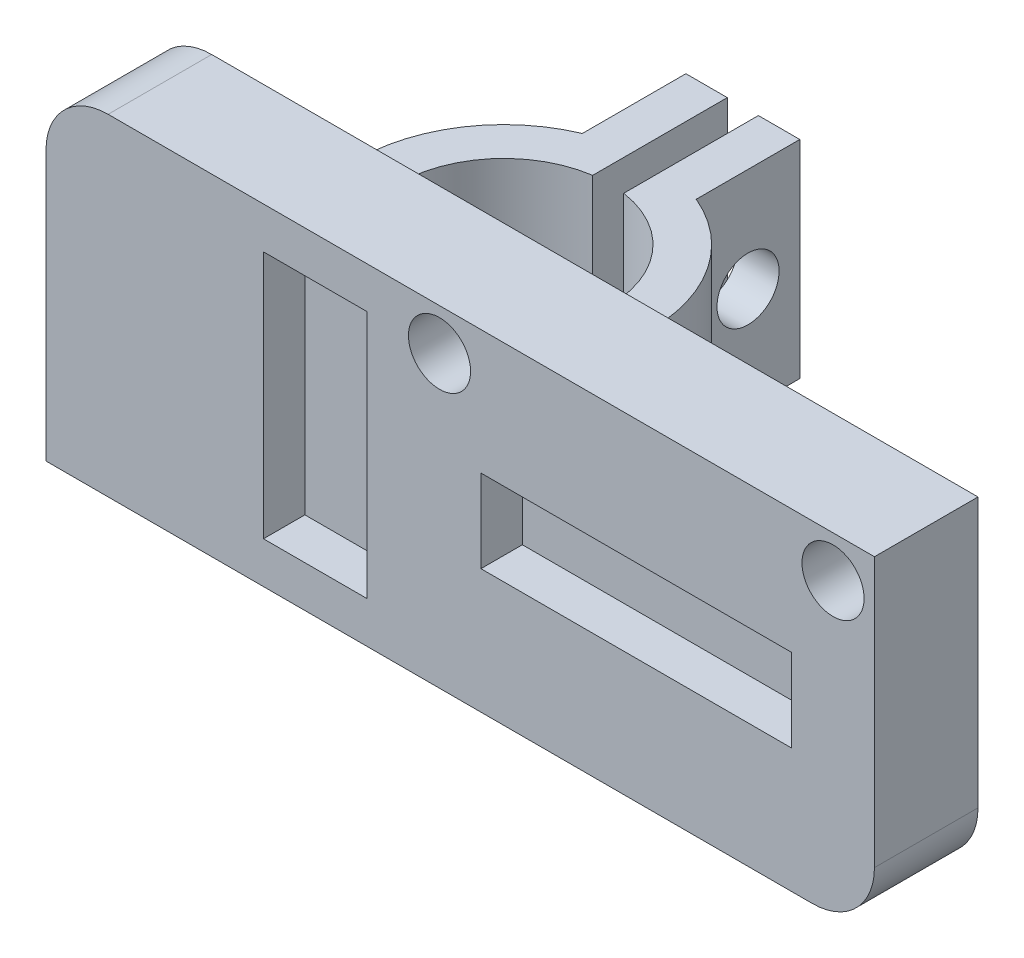
ISO-10303-21;
HEADER;
FILE_DESCRIPTION(('STEP AP214'),'2;1');
FILE_NAME('part.step','',(''),(''),'','','');
FILE_SCHEMA(('AUTOMOTIVE_DESIGN { 1 0 10303 214 1 1 1 1 }'));
ENDSEC;
DATA;
#1=APPLICATION_CONTEXT('core data for automotive mechanical design processes');
#2=APPLICATION_PROTOCOL_DEFINITION('international standard','automotive_design',2000,#1);
#3=PRODUCT_CONTEXT('',#1,'mechanical');
#4=PRODUCT('Part','Part','',(#3));
#5=PRODUCT_RELATED_PRODUCT_CATEGORY('part','',(#4));
#6=PRODUCT_DEFINITION_FORMATION('','',#4);
#7=PRODUCT_DEFINITION_CONTEXT('part definition',#1,'design');
#8=PRODUCT_DEFINITION('design','',#6,#7);
#9=PRODUCT_DEFINITION_SHAPE('','',#8);
#10=(LENGTH_UNIT() NAMED_UNIT(*) SI_UNIT(.MILLI.,.METRE.));
#11=(NAMED_UNIT(*) PLANE_ANGLE_UNIT() SI_UNIT($,.RADIAN.));
#12=(NAMED_UNIT(*) SI_UNIT($,.STERADIAN.) SOLID_ANGLE_UNIT());
#13=UNCERTAINTY_MEASURE_WITH_UNIT(LENGTH_MEASURE(1.E-05),#10,'distance_accuracy_value','');
#14=(GEOMETRIC_REPRESENTATION_CONTEXT(3) GLOBAL_UNCERTAINTY_ASSIGNED_CONTEXT((#13)) GLOBAL_UNIT_ASSIGNED_CONTEXT((#10,
#11,#12)) REPRESENTATION_CONTEXT('',''));
#15=CARTESIAN_POINT('',(0.,0.,0.));
#16=DIRECTION('',(0.,0.,1.));
#17=DIRECTION('',(1.,0.,0.));
#18=AXIS2_PLACEMENT_3D('',#15,#16,#17);
#19=CARTESIAN_POINT('',(0.,0.,-5.));
#20=DIRECTION('',(0.,0.,1.));
#21=DIRECTION('',(1.,0.,0.));
#22=AXIS2_PLACEMENT_3D('',#19,#20,#21);
#23=PLANE('',#22);
#24=CARTESIAN_POINT('',(19.,14.,-5.));
#25=DIRECTION('',(0.,0.,1.));
#26=DIRECTION('',(1.,0.,0.));
#27=AXIS2_PLACEMENT_3D('',#24,#25,#26);
#28=CIRCLE('',#27,1.5);
#29=CARTESIAN_POINT('',(20.5,14.,-5.));
#30=VERTEX_POINT('',#29);
#31=EDGE_CURVE('E413',#30,#30,#28,.T.);
#32=ORIENTED_EDGE('',*,*,#31,.T.);
#33=EDGE_LOOP('',(#32));
#34=FACE_BOUND('',#33,.T.);
#35=CARTESIAN_POINT('',(38.,14.,-5.));
#36=DIRECTION('',(0.,0.,1.));
#37=DIRECTION('',(1.,0.,0.));
#38=AXIS2_PLACEMENT_3D('',#35,#36,#37);
#39=CIRCLE('',#38,1.5);
#40=CARTESIAN_POINT('',(39.5,14.,-5.));
#41=VERTEX_POINT('',#40);
#42=EDGE_CURVE('E410',#41,#41,#39,.T.);
#43=ORIENTED_EDGE('',*,*,#42,.T.);
#44=EDGE_LOOP('',(#43));
#45=FACE_BOUND('',#44,.T.);
#46=DIRECTION('',(0.,-1.,0.));
#47=VECTOR('',#46,1.);
#48=CARTESIAN_POINT('',(4.9,10.,-5.));
#49=LINE('',#48,#47);
#50=CARTESIAN_POINT('',(4.9,10.,-5.));
#51=VERTEX_POINT('',#50);
#52=CARTESIAN_POINT('',(4.9,0.,-5.));
#53=VERTEX_POINT('',#52);
#54=EDGE_CURVE('E98',#51,#53,#49,.T.);
#55=ORIENTED_EDGE('',*,*,#54,.T.);
#56=DIRECTION('',(1.,0.,0.));
#57=VECTOR('',#56,1.);
#58=CARTESIAN_POINT('',(0.,0.,-5.));
#59=LINE('',#58,#57);
#60=CARTESIAN_POINT('',(0.,0.,-5.));
#61=VERTEX_POINT('',#60);
#62=EDGE_CURVE('E261',#61,#53,#59,.T.);
#63=ORIENTED_EDGE('',*,*,#62,.F.);
#64=DIRECTION('',(0.,-1.,0.));
#65=VECTOR('',#64,1.);
#66=CARTESIAN_POINT('',(0.,0.,-5.));
#67=LINE('',#66,#65);
#68=CARTESIAN_POINT('',(0.,13.,-5.));
#69=VERTEX_POINT('',#68);
#70=EDGE_CURVE('E426',#69,#61,#67,.T.);
#71=ORIENTED_EDGE('',*,*,#70,.F.);
#72=CARTESIAN_POINT('',(3.,13.,-5.));
#73=DIRECTION('',(0.,0.,1.));
#74=DIRECTION('',(1.,0.,0.));
#75=AXIS2_PLACEMENT_3D('',#72,#73,#74);
#76=CIRCLE('',#75,3.);
#77=CARTESIAN_POINT('',(3.,16.,-5.));
#78=VERTEX_POINT('',#77);
#79=EDGE_CURVE('E424',#69,#78,#76,.F.);
#80=ORIENTED_EDGE('',*,*,#79,.T.);
#81=DIRECTION('',(1.,0.,0.));
#82=VECTOR('',#81,1.);
#83=CARTESIAN_POINT('',(0.,16.,-5.));
#84=LINE('',#83,#82);
#85=CARTESIAN_POINT('',(40.,16.,-5.));
#86=VERTEX_POINT('',#85);
#87=EDGE_CURVE('E422',#78,#86,#84,.T.);
#88=ORIENTED_EDGE('',*,*,#87,.T.);
#89=DIRECTION('',(0.,-1.,0.));
#90=VECTOR('',#89,1.);
#91=CARTESIAN_POINT('',(40.,0.,-5.));
#92=LINE('',#91,#90);
#93=CARTESIAN_POINT('',(40.,3.,-5.));
#94=VERTEX_POINT('',#93);
#95=EDGE_CURVE('E420',#86,#94,#92,.T.);
#96=ORIENTED_EDGE('',*,*,#95,.T.);
#97=CARTESIAN_POINT('',(37.,3.,-5.));
#98=DIRECTION('',(0.,0.,1.));
#99=DIRECTION('',(1.,0.,0.));
#100=AXIS2_PLACEMENT_3D('',#97,#98,#99);
#101=CIRCLE('',#100,3.);
#102=CARTESIAN_POINT('',(37.,0.,-5.));
#103=VERTEX_POINT('',#102);
#104=EDGE_CURVE('E417',#94,#103,#101,.F.);
#105=ORIENTED_EDGE('',*,*,#104,.T.);
#106=CARTESIAN_POINT('',(19.1,0.,-5.));
#107=VERTEX_POINT('',#106);
#108=EDGE_CURVE('E429',#107,#103,#59,.T.);
#109=ORIENTED_EDGE('',*,*,#108,.F.);
#110=DIRECTION('',(0.,-1.,0.));
#111=VECTOR('',#110,1.);
#112=CARTESIAN_POINT('',(19.1,10.,-5.));
#113=LINE('',#112,#111);
#114=CARTESIAN_POINT('',(19.1,10.,-5.));
#115=VERTEX_POINT('',#114);
#116=EDGE_CURVE('E333',#115,#107,#113,.T.);
#117=ORIENTED_EDGE('',*,*,#116,.F.);
#118=DIRECTION('',(1.,0.,0.));
#119=VECTOR('',#118,1.);
#120=CARTESIAN_POINT('',(0.,10.,-5.));
#121=LINE('',#120,#119);
#122=CARTESIAN_POINT('',(12.,10.,-5.));
#123=VERTEX_POINT('',#122);
#124=EDGE_CURVE('E316',#123,#115,#121,.T.);
#125=ORIENTED_EDGE('',*,*,#124,.F.);
#126=DIRECTION('',(1.,0.,0.));
#127=VECTOR('',#126,1.);
#128=CARTESIAN_POINT('',(0.,10.,-5.));
#129=LINE('',#128,#127);
#130=EDGE_CURVE('E93',#51,#123,#129,.T.);
#131=ORIENTED_EDGE('',*,*,#130,.F.);
#132=EDGE_LOOP('',(#55,#63,#71,#80,#88,#96,#105,#109,#117,#125,#131));
#133=FACE_BOUND('',#132,.T.);
#134=ADVANCED_FACE('F76',(#34,#45,#133),#23,.F.);
#135=CARTESIAN_POINT('',(37.,3.,-5.));
#136=DIRECTION('',(0.,0.,1.));
#137=DIRECTION('',(1.,0.,0.));
#138=AXIS2_PLACEMENT_3D('',#135,#136,#137);
#139=CYLINDRICAL_SURFACE('',#138,3.);
#140=CARTESIAN_POINT('',(37.,3.,0.));
#141=DIRECTION('',(0.,0.,1.));
#142=DIRECTION('',(1.,0.,0.));
#143=AXIS2_PLACEMENT_3D('',#140,#141,#142);
#144=CIRCLE('',#143,3.);
#145=CARTESIAN_POINT('',(40.,3.,0.));
#146=VERTEX_POINT('',#145);
#147=CARTESIAN_POINT('',(37.,0.,0.));
#148=VERTEX_POINT('',#147);
#149=EDGE_CURVE('E437',#146,#148,#144,.F.);
#150=ORIENTED_EDGE('',*,*,#149,.T.);
#151=DIRECTION('',(0.,0.,1.));
#152=VECTOR('',#151,1.);
#153=CARTESIAN_POINT('',(37.,0.,-5.));
#154=LINE('',#153,#152);
#155=EDGE_CURVE('E12',#103,#148,#154,.T.);
#156=ORIENTED_EDGE('',*,*,#155,.F.);
#157=ORIENTED_EDGE('',*,*,#104,.F.);
#158=DIRECTION('',(0.,0.,1.));
#159=VECTOR('',#158,1.);
#160=CARTESIAN_POINT('',(40.,3.,-5.));
#161=LINE('',#160,#159);
#162=EDGE_CURVE('E431',#94,#146,#161,.T.);
#163=ORIENTED_EDGE('',*,*,#162,.T.);
#164=EDGE_LOOP('',(#150,#156,#157,#163));
#165=FACE_BOUND('',#164,.T.);
#166=ADVANCED_FACE('F464',(#165),#139,.T.);
#167=CARTESIAN_POINT('',(0.,0.,-5.));
#168=DIRECTION('',(0.,-1.,0.));
#169=DIRECTION('',(0.,0.,-1.));
#170=AXIS2_PLACEMENT_3D('',#167,#168,#169);
#171=PLANE('',#170);
#172=DIRECTION('',(1.,0.,0.));
#173=VECTOR('',#172,1.);
#174=CARTESIAN_POINT('',(0.,0.,0.));
#175=LINE('',#174,#173);
#176=CARTESIAN_POINT('',(0.,0.,0.));
#177=VERTEX_POINT('',#176);
#178=EDGE_CURVE('E414',#177,#148,#175,.T.);
#179=ORIENTED_EDGE('',*,*,#178,.F.);
#180=DIRECTION('',(0.,0.,1.));
#181=VECTOR('',#180,1.);
#182=CARTESIAN_POINT('',(0.,0.,-5.));
#183=LINE('',#182,#181);
#184=EDGE_CURVE('E85',#61,#177,#183,.T.);
#185=ORIENTED_EDGE('',*,*,#184,.F.);
#186=ORIENTED_EDGE('',*,*,#62,.T.);
#187=DIRECTION('',(0.,0.,1.));
#188=VECTOR('',#187,1.);
#189=CARTESIAN_POINT('',(4.9,0.,0.));
#190=LINE('',#189,#188);
#191=CARTESIAN_POINT('',(4.9,0.,-10.1));
#192=VERTEX_POINT('',#191);
#193=EDGE_CURVE('E254',#192,#53,#190,.T.);
#194=ORIENTED_EDGE('',*,*,#193,.F.);
#195=CARTESIAN_POINT('',(12.,0.,-10.1));
#196=DIRECTION('',(0.,-1.,0.));
#197=DIRECTION('',(0.,0.,-1.));
#198=AXIS2_PLACEMENT_3D('',#195,#196,#197);
#199=CIRCLE('',#198,7.1);
#200=CARTESIAN_POINT('',(9.25,0.,-16.6458001802683));
#201=VERTEX_POINT('',#200);
#202=EDGE_CURVE('E260',#201,#192,#199,.F.);
#203=ORIENTED_EDGE('',*,*,#202,.F.);
#204=DIRECTION('',(0.,0.,1.));
#205=VECTOR('',#204,1.);
#206=CARTESIAN_POINT('',(9.24999999999999,0.,0.));
#207=LINE('',#206,#205);
#208=CARTESIAN_POINT('',(9.25,0.,-21.6458001802683));
#209=VERTEX_POINT('',#208);
#210=EDGE_CURVE('E284',#209,#201,#207,.T.);
#211=ORIENTED_EDGE('',*,*,#210,.F.);
#212=DIRECTION('',(-1.,0.,0.));
#213=VECTOR('',#212,1.);
#214=CARTESIAN_POINT('',(0.,0.,-21.6458001802683));
#215=LINE('',#214,#213);
#216=CARTESIAN_POINT('',(11.25,0.,-21.6458001802683));
#217=VERTEX_POINT('',#216);
#218=EDGE_CURVE('E840',#217,#209,#215,.T.);
#219=ORIENTED_EDGE('',*,*,#218,.F.);
#220=DIRECTION('',(0.,0.,-1.));
#221=VECTOR('',#220,1.);
#222=CARTESIAN_POINT('',(11.25,0.,0.));
#223=LINE('',#222,#221);
#224=CARTESIAN_POINT('',(11.25,0.,-15.1445515162401));
#225=VERTEX_POINT('',#224);
#226=EDGE_CURVE('E844',#225,#217,#223,.T.);
#227=ORIENTED_EDGE('',*,*,#226,.F.);
#228=CARTESIAN_POINT('',(12.,0.,-10.1));
#229=DIRECTION('',(0.,-1.,0.));
#230=DIRECTION('',(0.,0.,-1.));
#231=AXIS2_PLACEMENT_3D('',#228,#229,#230);
#232=CIRCLE('',#231,5.1);
#233=CARTESIAN_POINT('',(12.75,0.,-15.1445515162401));
#234=VERTEX_POINT('',#233);
#235=EDGE_CURVE('E297',#234,#225,#232,.T.);
#236=ORIENTED_EDGE('',*,*,#235,.F.);
#237=DIRECTION('',(0.,0.,-1.));
#238=VECTOR('',#237,1.);
#239=CARTESIAN_POINT('',(12.75,0.,0.));
#240=LINE('',#239,#238);
#241=CARTESIAN_POINT('',(12.75,0.,-21.6458001802683));
#242=VERTEX_POINT('',#241);
#243=EDGE_CURVE('E320',#234,#242,#240,.T.);
#244=ORIENTED_EDGE('',*,*,#243,.T.);
#245=DIRECTION('',(1.,0.,0.));
#246=VECTOR('',#245,1.);
#247=CARTESIAN_POINT('',(0.,0.,-21.6458001802683));
#248=LINE('',#247,#246);
#249=CARTESIAN_POINT('',(14.75,0.,-21.6458001802683));
#250=VERTEX_POINT('',#249);
#251=EDGE_CURVE('E323',#242,#250,#248,.T.);
#252=ORIENTED_EDGE('',*,*,#251,.T.);
#253=DIRECTION('',(0.,0.,1.));
#254=VECTOR('',#253,1.);
#255=CARTESIAN_POINT('',(14.75,0.,0.));
#256=LINE('',#255,#254);
#257=CARTESIAN_POINT('',(14.75,0.,-16.6458001802683));
#258=VERTEX_POINT('',#257);
#259=EDGE_CURVE('E326',#250,#258,#256,.T.);
#260=ORIENTED_EDGE('',*,*,#259,.T.);
#261=CARTESIAN_POINT('',(12.,0.,-10.1));
#262=DIRECTION('',(0.,-1.,0.));
#263=DIRECTION('',(0.,0.,-1.));
#264=AXIS2_PLACEMENT_3D('',#261,#262,#263);
#265=CIRCLE('',#264,7.1);
#266=CARTESIAN_POINT('',(19.1,0.,-10.1));
#267=VERTEX_POINT('',#266);
#268=EDGE_CURVE('E329',#267,#258,#265,.F.);
#269=ORIENTED_EDGE('',*,*,#268,.F.);
#270=DIRECTION('',(0.,0.,-1.));
#271=VECTOR('',#270,1.);
#272=CARTESIAN_POINT('',(19.1,0.,0.));
#273=LINE('',#272,#271);
#274=EDGE_CURVE('E303',#107,#267,#273,.T.);
#275=ORIENTED_EDGE('',*,*,#274,.F.);
#276=ORIENTED_EDGE('',*,*,#108,.T.);
#277=ORIENTED_EDGE('',*,*,#155,.T.);
#278=EDGE_LOOP('',(#179,#185,#186,#194,#203,#211,#219,#227,#236,#244,#252,#260,#269,#275,#276,#277));
#279=FACE_BOUND('',#278,.T.);
#280=ADVANCED_FACE('F257',(#279),#171,.T.);
#281=CARTESIAN_POINT('',(0.,0.,-5.));
#282=DIRECTION('',(-1.,0.,0.));
#283=DIRECTION('',(0.,0.,1.));
#284=AXIS2_PLACEMENT_3D('',#281,#282,#283);
#285=PLANE('',#284);
#286=DIRECTION('',(0.,-1.,0.));
#287=VECTOR('',#286,1.);
#288=CARTESIAN_POINT('',(0.,0.,0.));
#289=LINE('',#288,#287);
#290=CARTESIAN_POINT('',(0.,13.,0.));
#291=VERTEX_POINT('',#290);
#292=EDGE_CURVE('E446',#291,#177,#289,.T.);
#293=ORIENTED_EDGE('',*,*,#292,.F.);
#294=DIRECTION('',(0.,0.,1.));
#295=VECTOR('',#294,1.);
#296=CARTESIAN_POINT('',(0.,13.,-5.));
#297=LINE('',#296,#295);
#298=EDGE_CURVE('E452',#69,#291,#297,.T.);
#299=ORIENTED_EDGE('',*,*,#298,.F.);
#300=ORIENTED_EDGE('',*,*,#70,.T.);
#301=ORIENTED_EDGE('',*,*,#184,.T.);
#302=EDGE_LOOP('',(#293,#299,#300,#301));
#303=FACE_BOUND('',#302,.T.);
#304=ADVANCED_FACE('F485',(#303),#285,.T.);
#305=CARTESIAN_POINT('',(3.,13.,-5.));
#306=DIRECTION('',(0.,0.,1.));
#307=DIRECTION('',(1.,0.,0.));
#308=AXIS2_PLACEMENT_3D('',#305,#306,#307);
#309=CYLINDRICAL_SURFACE('',#308,3.);
#310=CARTESIAN_POINT('',(3.,13.,0.));
#311=DIRECTION('',(0.,0.,1.));
#312=DIRECTION('',(1.,0.,0.));
#313=AXIS2_PLACEMENT_3D('',#310,#311,#312);
#314=CIRCLE('',#313,3.);
#315=CARTESIAN_POINT('',(3.,16.,0.));
#316=VERTEX_POINT('',#315);
#317=EDGE_CURVE('E444',#291,#316,#314,.F.);
#318=ORIENTED_EDGE('',*,*,#317,.T.);
#319=DIRECTION('',(0.,0.,1.));
#320=VECTOR('',#319,1.);
#321=CARTESIAN_POINT('',(3.,16.,-5.));
#322=LINE('',#321,#320);
#323=EDGE_CURVE('E454',#78,#316,#322,.T.);
#324=ORIENTED_EDGE('',*,*,#323,.F.);
#325=ORIENTED_EDGE('',*,*,#79,.F.);
#326=ORIENTED_EDGE('',*,*,#298,.T.);
#327=EDGE_LOOP('',(#318,#324,#325,#326));
#328=FACE_BOUND('',#327,.T.);
#329=ADVANCED_FACE('F488',(#328),#309,.T.);
#330=CARTESIAN_POINT('',(0.,16.,-5.));
#331=DIRECTION('',(0.,-1.,0.));
#332=DIRECTION('',(1.,0.,0.));
#333=AXIS2_PLACEMENT_3D('',#330,#331,#332);
#334=PLANE('',#333);
#335=DIRECTION('',(1.,0.,0.));
#336=VECTOR('',#335,1.);
#337=CARTESIAN_POINT('',(0.,16.,0.));
#338=LINE('',#337,#336);
#339=CARTESIAN_POINT('',(40.,16.,0.));
#340=VERTEX_POINT('',#339);
#341=EDGE_CURVE('E442',#316,#340,#338,.T.);
#342=ORIENTED_EDGE('',*,*,#341,.T.);
#343=DIRECTION('',(0.,0.,1.));
#344=VECTOR('',#343,1.);
#345=CARTESIAN_POINT('',(40.,16.,-5.));
#346=LINE('',#345,#344);
#347=EDGE_CURVE('E457',#86,#340,#346,.T.);
#348=ORIENTED_EDGE('',*,*,#347,.F.);
#349=ORIENTED_EDGE('',*,*,#87,.F.);
#350=ORIENTED_EDGE('',*,*,#323,.T.);
#351=EDGE_LOOP('',(#342,#348,#349,#350));
#352=FACE_BOUND('',#351,.T.);
#353=ADVANCED_FACE('F481',(#352),#334,.F.);
#354=CARTESIAN_POINT('',(19.,14.,-5.));
#355=DIRECTION('',(0.,0.,1.));
#356=DIRECTION('',(1.,0.,0.));
#357=AXIS2_PLACEMENT_3D('',#354,#355,#356);
#358=CYLINDRICAL_SURFACE('',#357,1.5);
#359=ORIENTED_EDGE('',*,*,#31,.F.);
#360=EDGE_LOOP('',(#359));
#361=FACE_BOUND('',#360,.T.);
#362=CARTESIAN_POINT('',(19.,14.,0.));
#363=DIRECTION('',(0.,0.,1.));
#364=DIRECTION('',(1.,0.,0.));
#365=AXIS2_PLACEMENT_3D('',#362,#363,#364);
#366=CIRCLE('',#365,1.5);
#367=CARTESIAN_POINT('',(20.5,14.,0.));
#368=VERTEX_POINT('',#367);
#369=EDGE_CURVE('E434',#368,#368,#366,.T.);
#370=ORIENTED_EDGE('',*,*,#369,.T.);
#371=EDGE_LOOP('',(#370));
#372=FACE_BOUND('',#371,.T.);
#373=ADVANCED_FACE('F495',(#361,#372),#358,.F.);
#374=CARTESIAN_POINT('',(38.,14.,-5.));
#375=DIRECTION('',(0.,0.,1.));
#376=DIRECTION('',(1.,0.,0.));
#377=AXIS2_PLACEMENT_3D('',#374,#375,#376);
#378=CYLINDRICAL_SURFACE('',#377,1.5);
#379=ORIENTED_EDGE('',*,*,#42,.F.);
#380=EDGE_LOOP('',(#379));
#381=FACE_BOUND('',#380,.T.);
#382=CARTESIAN_POINT('',(38.,14.,0.));
#383=DIRECTION('',(0.,0.,1.));
#384=DIRECTION('',(1.,0.,0.));
#385=AXIS2_PLACEMENT_3D('',#382,#383,#384);
#386=CIRCLE('',#385,1.5);
#387=CARTESIAN_POINT('',(39.5,14.,0.));
#388=VERTEX_POINT('',#387);
#389=EDGE_CURVE('E403',#388,#388,#386,.T.);
#390=ORIENTED_EDGE('',*,*,#389,.T.);
#391=EDGE_LOOP('',(#390));
#392=FACE_BOUND('',#391,.T.);
#393=ADVANCED_FACE('F78',(#381,#392),#378,.F.);
#394=CARTESIAN_POINT('',(40.,0.,-5.));
#395=DIRECTION('',(-1.,0.,0.));
#396=DIRECTION('',(0.,0.,1.));
#397=AXIS2_PLACEMENT_3D('',#394,#395,#396);
#398=PLANE('',#397);
#399=DIRECTION('',(0.,-1.,0.));
#400=VECTOR('',#399,1.);
#401=CARTESIAN_POINT('',(40.,0.,0.));
#402=LINE('',#401,#400);
#403=EDGE_CURVE('E440',#340,#146,#402,.T.);
#404=ORIENTED_EDGE('',*,*,#403,.T.);
#405=ORIENTED_EDGE('',*,*,#162,.F.);
#406=ORIENTED_EDGE('',*,*,#95,.F.);
#407=ORIENTED_EDGE('',*,*,#347,.T.);
#408=EDGE_LOOP('',(#404,#405,#406,#407));
#409=FACE_BOUND('',#408,.T.);
#410=ADVANCED_FACE('F479',(#409),#398,.F.);
#411=CARTESIAN_POINT('',(0.,0.,0.));
#412=DIRECTION('',(0.,0.,1.));
#413=DIRECTION('',(1.,0.,0.));
#414=AXIS2_PLACEMENT_3D('',#411,#412,#413);
#415=PLANE('',#414);
#416=DIRECTION('',(-1.,0.,0.));
#417=VECTOR('',#416,1.);
#418=CARTESIAN_POINT('',(0.,10.,0.));
#419=LINE('',#418,#417);
#420=CARTESIAN_POINT('',(36.,10.,0.));
#421=VERTEX_POINT('',#420);
#422=CARTESIAN_POINT('',(21.,10.,0.));
#423=VERTEX_POINT('',#422);
#424=EDGE_CURVE('E336',#421,#423,#419,.T.);
#425=ORIENTED_EDGE('',*,*,#424,.F.);
#426=DIRECTION('',(0.,1.,0.));
#427=VECTOR('',#426,1.);
#428=CARTESIAN_POINT('',(36.,0.,0.));
#429=LINE('',#428,#427);
#430=CARTESIAN_POINT('',(36.,6.00000000000001,0.));
#431=VERTEX_POINT('',#430);
#432=EDGE_CURVE('E351',#431,#421,#429,.T.);
#433=ORIENTED_EDGE('',*,*,#432,.F.);
#434=DIRECTION('',(-1.,0.,0.));
#435=VECTOR('',#434,1.);
#436=CARTESIAN_POINT('',(0.,6.,0.));
#437=LINE('',#436,#435);
#438=CARTESIAN_POINT('',(21.,6.,0.));
#439=VERTEX_POINT('',#438);
#440=EDGE_CURVE('E364',#431,#439,#437,.T.);
#441=ORIENTED_EDGE('',*,*,#440,.T.);
#442=DIRECTION('',(0.,-1.,0.));
#443=VECTOR('',#442,1.);
#444=CARTESIAN_POINT('',(21.,0.,0.));
#445=LINE('',#444,#443);
#446=EDGE_CURVE('E361',#423,#439,#445,.T.);
#447=ORIENTED_EDGE('',*,*,#446,.F.);
#448=EDGE_LOOP('',(#425,#433,#441,#447));
#449=FACE_BOUND('',#448,.T.);
#450=DIRECTION('',(-1.,0.,0.));
#451=VECTOR('',#450,1.);
#452=CARTESIAN_POINT('',(0.,14.,0.));
#453=LINE('',#452,#451);
#454=CARTESIAN_POINT('',(15.5,14.,0.));
#455=VERTEX_POINT('',#454);
#456=CARTESIAN_POINT('',(10.5,14.,0.));
#457=VERTEX_POINT('',#456);
#458=EDGE_CURVE('E371',#455,#457,#453,.T.);
#459=ORIENTED_EDGE('',*,*,#458,.F.);
#460=DIRECTION('',(0.,1.,0.));
#461=VECTOR('',#460,1.);
#462=CARTESIAN_POINT('',(15.5,0.,0.));
#463=LINE('',#462,#461);
#464=CARTESIAN_POINT('',(15.5,2.00000000000001,0.));
#465=VERTEX_POINT('',#464);
#466=EDGE_CURVE('E382',#465,#455,#463,.T.);
#467=ORIENTED_EDGE('',*,*,#466,.F.);
#468=DIRECTION('',(1.,0.,0.));
#469=VECTOR('',#468,1.);
#470=CARTESIAN_POINT('',(0.,2.00000000000001,0.));
#471=LINE('',#470,#469);
#472=CARTESIAN_POINT('',(10.5,2.00000000000001,0.));
#473=VERTEX_POINT('',#472);
#474=EDGE_CURVE('E396',#473,#465,#471,.T.);
#475=ORIENTED_EDGE('',*,*,#474,.F.);
#476=DIRECTION('',(0.,-1.,0.));
#477=VECTOR('',#476,1.);
#478=CARTESIAN_POINT('',(10.5,0.,0.));
#479=LINE('',#478,#477);
#480=EDGE_CURVE('E393',#457,#473,#479,.T.);
#481=ORIENTED_EDGE('',*,*,#480,.F.);
#482=EDGE_LOOP('',(#459,#467,#475,#481));
#483=FACE_BOUND('',#482,.T.);
#484=ORIENTED_EDGE('',*,*,#389,.F.);
#485=EDGE_LOOP('',(#484));
#486=FACE_BOUND('',#485,.T.);
#487=ORIENTED_EDGE('',*,*,#369,.F.);
#488=EDGE_LOOP('',(#487));
#489=FACE_BOUND('',#488,.T.);
#490=ORIENTED_EDGE('',*,*,#149,.F.);
#491=ORIENTED_EDGE('',*,*,#403,.F.);
#492=ORIENTED_EDGE('',*,*,#341,.F.);
#493=ORIENTED_EDGE('',*,*,#317,.F.);
#494=ORIENTED_EDGE('',*,*,#292,.T.);
#495=ORIENTED_EDGE('',*,*,#178,.T.);
#496=EDGE_LOOP('',(#490,#491,#492,#493,#494,#495));
#497=FACE_BOUND('',#496,.T.);
#498=ADVANCED_FACE('F470',(#449,#483,#486,#489,#497),#415,.T.);
#499=CARTESIAN_POINT('',(0.,14.,-2.));
#500=DIRECTION('',(0.,1.,0.));
#501=DIRECTION('',(0.,0.,1.));
#502=AXIS2_PLACEMENT_3D('',#499,#500,#501);
#503=PLANE('',#502);
#504=ORIENTED_EDGE('',*,*,#458,.T.);
#505=DIRECTION('',(0.,0.,1.));
#506=VECTOR('',#505,1.);
#507=CARTESIAN_POINT('',(10.5,14.,-2.));
#508=LINE('',#507,#506);
#509=CARTESIAN_POINT('',(10.5,14.,-2.));
#510=VERTEX_POINT('',#509);
#511=EDGE_CURVE('E391',#510,#457,#508,.T.);
#512=ORIENTED_EDGE('',*,*,#511,.F.);
#513=DIRECTION('',(-1.,0.,0.));
#514=VECTOR('',#513,1.);
#515=CARTESIAN_POINT('',(0.,14.,-2.));
#516=LINE('',#515,#514);
#517=CARTESIAN_POINT('',(15.5,14.,-2.));
#518=VERTEX_POINT('',#517);
#519=EDGE_CURVE('E378',#518,#510,#516,.T.);
#520=ORIENTED_EDGE('',*,*,#519,.F.);
#521=DIRECTION('',(0.,0.,1.));
#522=VECTOR('',#521,1.);
#523=CARTESIAN_POINT('',(15.5,14.,-2.));
#524=LINE('',#523,#522);
#525=EDGE_CURVE('E401',#518,#455,#524,.T.);
#526=ORIENTED_EDGE('',*,*,#525,.T.);
#527=EDGE_LOOP('',(#504,#512,#520,#526));
#528=FACE_BOUND('',#527,.T.);
#529=ADVANCED_FACE('F508',(#528),#503,.F.);
#530=CARTESIAN_POINT('',(15.5,0.,-2.));
#531=DIRECTION('',(1.,0.,0.));
#532=DIRECTION('',(0.,1.,0.));
#533=AXIS2_PLACEMENT_3D('',#530,#531,#532);
#534=PLANE('',#533);
#535=ORIENTED_EDGE('',*,*,#466,.T.);
#536=ORIENTED_EDGE('',*,*,#525,.F.);
#537=DIRECTION('',(0.,1.,0.));
#538=VECTOR('',#537,1.);
#539=CARTESIAN_POINT('',(15.5,0.,-2.));
#540=LINE('',#539,#538);
#541=CARTESIAN_POINT('',(15.5,2.00000000000001,-2.));
#542=VERTEX_POINT('',#541);
#543=EDGE_CURVE('E388',#542,#518,#540,.T.);
#544=ORIENTED_EDGE('',*,*,#543,.F.);
#545=DIRECTION('',(0.,0.,1.));
#546=VECTOR('',#545,1.);
#547=CARTESIAN_POINT('',(15.5,2.00000000000001,-2.));
#548=LINE('',#547,#546);
#549=EDGE_CURVE('E404',#542,#465,#548,.T.);
#550=ORIENTED_EDGE('',*,*,#549,.T.);
#551=EDGE_LOOP('',(#535,#536,#544,#550));
#552=FACE_BOUND('',#551,.T.);
#553=ADVANCED_FACE('F575',(#552),#534,.F.);
#554=CARTESIAN_POINT('',(0.,2.00000000000001,-2.));
#555=DIRECTION('',(0.,-1.,0.));
#556=DIRECTION('',(0.,0.,-1.));
#557=AXIS2_PLACEMENT_3D('',#554,#555,#556);
#558=PLANE('',#557);
#559=ORIENTED_EDGE('',*,*,#474,.T.);
#560=ORIENTED_EDGE('',*,*,#549,.F.);
#561=DIRECTION('',(1.,0.,0.));
#562=VECTOR('',#561,1.);
#563=CARTESIAN_POINT('',(0.,2.00000000000001,-2.));
#564=LINE('',#563,#562);
#565=CARTESIAN_POINT('',(10.5,2.00000000000001,-2.));
#566=VERTEX_POINT('',#565);
#567=EDGE_CURVE('E385',#566,#542,#564,.T.);
#568=ORIENTED_EDGE('',*,*,#567,.F.);
#569=DIRECTION('',(0.,0.,1.));
#570=VECTOR('',#569,1.);
#571=CARTESIAN_POINT('',(10.5,2.00000000000001,-2.));
#572=LINE('',#571,#570);
#573=EDGE_CURVE('E406',#566,#473,#572,.T.);
#574=ORIENTED_EDGE('',*,*,#573,.T.);
#575=EDGE_LOOP('',(#559,#560,#568,#574));
#576=FACE_BOUND('',#575,.T.);
#577=ADVANCED_FACE('F584',(#576),#558,.F.);
#578=CARTESIAN_POINT('',(10.5,0.,-2.));
#579=DIRECTION('',(-1.,0.,0.));
#580=DIRECTION('',(0.,-1.,0.));
#581=AXIS2_PLACEMENT_3D('',#578,#579,#580);
#582=PLANE('',#581);
#583=ORIENTED_EDGE('',*,*,#480,.T.);
#584=ORIENTED_EDGE('',*,*,#573,.F.);
#585=DIRECTION('',(0.,-1.,0.));
#586=VECTOR('',#585,1.);
#587=CARTESIAN_POINT('',(10.5,0.,-2.));
#588=LINE('',#587,#586);
#589=EDGE_CURVE('E381',#510,#566,#588,.T.);
#590=ORIENTED_EDGE('',*,*,#589,.F.);
#591=ORIENTED_EDGE('',*,*,#511,.T.);
#592=EDGE_LOOP('',(#583,#584,#590,#591));
#593=FACE_BOUND('',#592,.T.);
#594=ADVANCED_FACE('F594',(#593),#582,.F.);
#595=CARTESIAN_POINT('',(0.,0.,-2.));
#596=DIRECTION('',(0.,0.,1.));
#597=DIRECTION('',(1.,0.,0.));
#598=AXIS2_PLACEMENT_3D('',#595,#596,#597);
#599=PLANE('',#598);
#600=ORIENTED_EDGE('',*,*,#519,.T.);
#601=ORIENTED_EDGE('',*,*,#589,.T.);
#602=ORIENTED_EDGE('',*,*,#567,.T.);
#603=ORIENTED_EDGE('',*,*,#543,.T.);
#604=EDGE_LOOP('',(#600,#601,#602,#603));
#605=FACE_BOUND('',#604,.T.);
#606=ADVANCED_FACE('F604',(#605),#599,.T.);
#607=CARTESIAN_POINT('',(0.,10.,-2.));
#608=DIRECTION('',(0.,1.,0.));
#609=DIRECTION('',(-1.,0.,0.));
#610=AXIS2_PLACEMENT_3D('',#607,#608,#609);
#611=PLANE('',#610);
#612=ORIENTED_EDGE('',*,*,#424,.T.);
#613=DIRECTION('',(0.,0.,1.));
#614=VECTOR('',#613,1.);
#615=CARTESIAN_POINT('',(21.,10.,-2.));
#616=LINE('',#615,#614);
#617=CARTESIAN_POINT('',(21.,10.,-2.));
#618=VERTEX_POINT('',#617);
#619=EDGE_CURVE('E359',#618,#423,#616,.T.);
#620=ORIENTED_EDGE('',*,*,#619,.F.);
#621=DIRECTION('',(-1.,0.,0.));
#622=VECTOR('',#621,1.);
#623=CARTESIAN_POINT('',(0.,10.,-2.));
#624=LINE('',#623,#622);
#625=CARTESIAN_POINT('',(36.,10.,-2.));
#626=VERTEX_POINT('',#625);
#627=EDGE_CURVE('E347',#626,#618,#624,.T.);
#628=ORIENTED_EDGE('',*,*,#627,.F.);
#629=DIRECTION('',(0.,0.,1.));
#630=VECTOR('',#629,1.);
#631=CARTESIAN_POINT('',(36.,10.,-2.));
#632=LINE('',#631,#630);
#633=EDGE_CURVE('E369',#626,#421,#632,.T.);
#634=ORIENTED_EDGE('',*,*,#633,.T.);
#635=EDGE_LOOP('',(#612,#620,#628,#634));
#636=FACE_BOUND('',#635,.T.);
#637=ADVANCED_FACE('F613',(#636),#611,.F.);
#638=CARTESIAN_POINT('',(36.,0.,-2.));
#639=DIRECTION('',(1.,0.,0.));
#640=DIRECTION('',(0.,0.,-1.));
#641=AXIS2_PLACEMENT_3D('',#638,#639,#640);
#642=PLANE('',#641);
#643=ORIENTED_EDGE('',*,*,#432,.T.);
#644=ORIENTED_EDGE('',*,*,#633,.F.);
#645=DIRECTION('',(0.,1.,0.));
#646=VECTOR('',#645,1.);
#647=CARTESIAN_POINT('',(36.,0.,-2.));
#648=LINE('',#647,#646);
#649=CARTESIAN_POINT('',(36.,6.00000000000001,-2.));
#650=VERTEX_POINT('',#649);
#651=EDGE_CURVE('E356',#650,#626,#648,.T.);
#652=ORIENTED_EDGE('',*,*,#651,.F.);
#653=DIRECTION('',(0.,0.,1.));
#654=VECTOR('',#653,1.);
#655=CARTESIAN_POINT('',(36.,6.00000000000001,-2.));
#656=LINE('',#655,#654);
#657=EDGE_CURVE('E372',#650,#431,#656,.T.);
#658=ORIENTED_EDGE('',*,*,#657,.T.);
#659=EDGE_LOOP('',(#643,#644,#652,#658));
#660=FACE_BOUND('',#659,.T.);
#661=ADVANCED_FACE('F623',(#660),#642,.F.);
#662=CARTESIAN_POINT('',(0.,6.,-2.));
#663=DIRECTION('',(0.,1.,0.));
#664=DIRECTION('',(-1.,0.,0.));
#665=AXIS2_PLACEMENT_3D('',#662,#663,#664);
#666=PLANE('',#665);
#667=ORIENTED_EDGE('',*,*,#440,.F.);
#668=ORIENTED_EDGE('',*,*,#657,.F.);
#669=DIRECTION('',(-1.,0.,0.));
#670=VECTOR('',#669,1.);
#671=CARTESIAN_POINT('',(0.,6.,-2.));
#672=LINE('',#671,#670);
#673=CARTESIAN_POINT('',(21.,6.,-2.));
#674=VERTEX_POINT('',#673);
#675=EDGE_CURVE('E354',#650,#674,#672,.T.);
#676=ORIENTED_EDGE('',*,*,#675,.T.);
#677=DIRECTION('',(0.,0.,1.));
#678=VECTOR('',#677,1.);
#679=CARTESIAN_POINT('',(21.,6.,-2.));
#680=LINE('',#679,#678);
#681=EDGE_CURVE('E374',#674,#439,#680,.T.);
#682=ORIENTED_EDGE('',*,*,#681,.T.);
#683=EDGE_LOOP('',(#667,#668,#676,#682));
#684=FACE_BOUND('',#683,.T.);
#685=ADVANCED_FACE('F633',(#684),#666,.T.);
#686=CARTESIAN_POINT('',(21.,0.,-2.));
#687=DIRECTION('',(-1.,0.,0.));
#688=DIRECTION('',(0.,-1.,0.));
#689=AXIS2_PLACEMENT_3D('',#686,#687,#688);
#690=PLANE('',#689);
#691=ORIENTED_EDGE('',*,*,#446,.T.);
#692=ORIENTED_EDGE('',*,*,#681,.F.);
#693=DIRECTION('',(0.,-1.,0.));
#694=VECTOR('',#693,1.);
#695=CARTESIAN_POINT('',(21.,0.,-2.));
#696=LINE('',#695,#694);
#697=EDGE_CURVE('E350',#618,#674,#696,.T.);
#698=ORIENTED_EDGE('',*,*,#697,.F.);
#699=ORIENTED_EDGE('',*,*,#619,.T.);
#700=EDGE_LOOP('',(#691,#692,#698,#699));
#701=FACE_BOUND('',#700,.T.);
#702=ADVANCED_FACE('F643',(#701),#690,.F.);
#703=CARTESIAN_POINT('',(0.,0.,-2.));
#704=DIRECTION('',(0.,0.,1.));
#705=DIRECTION('',(1.,0.,0.));
#706=AXIS2_PLACEMENT_3D('',#703,#704,#705);
#707=PLANE('',#706);
#708=ORIENTED_EDGE('',*,*,#627,.T.);
#709=ORIENTED_EDGE('',*,*,#697,.T.);
#710=ORIENTED_EDGE('',*,*,#675,.F.);
#711=ORIENTED_EDGE('',*,*,#651,.T.);
#712=EDGE_LOOP('',(#708,#709,#710,#711));
#713=FACE_BOUND('',#712,.T.);
#714=ADVANCED_FACE('F653',(#713),#707,.T.);
#715=CARTESIAN_POINT('',(12.,10.,-10.1));
#716=DIRECTION('',(0.,-1.,0.));
#717=DIRECTION('',(0.,0.,-1.));
#718=AXIS2_PLACEMENT_3D('',#715,#716,#717);
#719=CYLINDRICAL_SURFACE('',#718,5.1);
#720=ORIENTED_EDGE('',*,*,#235,.T.);
#721=DIRECTION('',(0.,-1.,0.));
#722=VECTOR('',#721,1.);
#723=CARTESIAN_POINT('',(11.25,10.,-15.1445515162401));
#724=LINE('',#723,#722);
#725=CARTESIAN_POINT('',(11.25,10.,-15.1445515162401));
#726=VERTEX_POINT('',#725);
#727=EDGE_CURVE('E841',#726,#225,#724,.T.);
#728=ORIENTED_EDGE('',*,*,#727,.F.);
#729=CARTESIAN_POINT('',(12.,10.,-10.1));
#730=DIRECTION('',(0.,-1.,0.));
#731=DIRECTION('',(0.,0.,-1.));
#732=AXIS2_PLACEMENT_3D('',#729,#730,#731);
#733=CIRCLE('',#732,5.1);
#734=EDGE_CURVE('E289',#123,#726,#733,.T.);
#735=ORIENTED_EDGE('',*,*,#734,.F.);
#736=CARTESIAN_POINT('',(12.,10.,-10.1));
#737=DIRECTION('',(0.,-1.,0.));
#738=DIRECTION('',(0.,0.,-1.));
#739=AXIS2_PLACEMENT_3D('',#736,#737,#738);
#740=CIRCLE('',#739,5.1);
#741=CARTESIAN_POINT('',(12.75,10.,-15.1445515162401));
#742=VERTEX_POINT('',#741);
#743=EDGE_CURVE('E300',#742,#123,#740,.T.);
#744=ORIENTED_EDGE('',*,*,#743,.F.);
#745=DIRECTION('',(0.,-1.,0.));
#746=VECTOR('',#745,1.);
#747=CARTESIAN_POINT('',(12.75,10.,-15.1445515162401));
#748=LINE('',#747,#746);
#749=EDGE_CURVE('E318',#742,#234,#748,.T.);
#750=ORIENTED_EDGE('',*,*,#749,.T.);
#751=EDGE_LOOP('',(#720,#728,#735,#744,#750));
#752=FACE_BOUND('',#751,.T.);
#753=ADVANCED_FACE('F662',(#752),#719,.F.);
#754=CARTESIAN_POINT('',(19.1,10.,0.));
#755=DIRECTION('',(-1.,0.,0.));
#756=DIRECTION('',(0.,0.,1.));
#757=AXIS2_PLACEMENT_3D('',#754,#755,#756);
#758=PLANE('',#757);
#759=ORIENTED_EDGE('',*,*,#274,.T.);
#760=DIRECTION('',(0.,-1.,0.));
#761=VECTOR('',#760,1.);
#762=CARTESIAN_POINT('',(19.1,10.,-10.1));
#763=LINE('',#762,#761);
#764=CARTESIAN_POINT('',(19.1,10.,-10.1));
#765=VERTEX_POINT('',#764);
#766=EDGE_CURVE('E337',#765,#267,#763,.T.);
#767=ORIENTED_EDGE('',*,*,#766,.F.);
#768=DIRECTION('',(0.,0.,-1.));
#769=VECTOR('',#768,1.);
#770=CARTESIAN_POINT('',(19.1,10.,0.));
#771=LINE('',#770,#769);
#772=EDGE_CURVE('E314',#115,#765,#771,.T.);
#773=ORIENTED_EDGE('',*,*,#772,.F.);
#774=ORIENTED_EDGE('',*,*,#116,.T.);
#775=EDGE_LOOP('',(#759,#767,#773,#774));
#776=FACE_BOUND('',#775,.T.);
#777=ADVANCED_FACE('F684',(#776),#758,.F.);
#778=CARTESIAN_POINT('',(12.,10.,-10.1));
#779=DIRECTION('',(0.,-1.,0.));
#780=DIRECTION('',(0.,0.,-1.));
#781=AXIS2_PLACEMENT_3D('',#778,#779,#780);
#782=CYLINDRICAL_SURFACE('',#781,7.1);
#783=ORIENTED_EDGE('',*,*,#268,.T.);
#784=DIRECTION('',(0.,-1.,0.));
#785=VECTOR('',#784,1.);
#786=CARTESIAN_POINT('',(14.75,10.,-16.6458001802683));
#787=LINE('',#786,#785);
#788=CARTESIAN_POINT('',(14.75,10.,-16.6458001802683));
#789=VERTEX_POINT('',#788);
#790=EDGE_CURVE('E340',#789,#258,#787,.T.);
#791=ORIENTED_EDGE('',*,*,#790,.F.);
#792=CARTESIAN_POINT('',(12.,10.,-10.1));
#793=DIRECTION('',(0.,-1.,0.));
#794=DIRECTION('',(0.,0.,-1.));
#795=AXIS2_PLACEMENT_3D('',#792,#793,#794);
#796=CIRCLE('',#795,7.1);
#797=EDGE_CURVE('E312',#765,#789,#796,.F.);
#798=ORIENTED_EDGE('',*,*,#797,.F.);
#799=ORIENTED_EDGE('',*,*,#766,.T.);
#800=EDGE_LOOP('',(#783,#791,#798,#799));
#801=FACE_BOUND('',#800,.T.);
#802=ADVANCED_FACE('F696',(#801),#782,.T.);
#803=CARTESIAN_POINT('',(14.75,10.,0.));
#804=DIRECTION('',(1.,0.,0.));
#805=DIRECTION('',(0.,0.,-1.));
#806=AXIS2_PLACEMENT_3D('',#803,#804,#805);
#807=PLANE('',#806);
#808=CARTESIAN_POINT('',(14.75,5.,-19.1458001802683));
#809=DIRECTION('',(1.,0.,0.));
#810=DIRECTION('',(0.,0.,-1.));
#811=AXIS2_PLACEMENT_3D('',#808,#809,#810);
#812=CIRCLE('',#811,1.5);
#813=CARTESIAN_POINT('',(14.75,5.,-20.6458001802683));
#814=VERTEX_POINT('',#813);
#815=EDGE_CURVE('E829',#814,#814,#812,.T.);
#816=ORIENTED_EDGE('',*,*,#815,.F.);
#817=EDGE_LOOP('',(#816));
#818=FACE_BOUND('',#817,.T.);
#819=ORIENTED_EDGE('',*,*,#259,.F.);
#820=DIRECTION('',(0.,-1.,0.));
#821=VECTOR('',#820,1.);
#822=CARTESIAN_POINT('',(14.75,10.,-21.6458001802683));
#823=LINE('',#822,#821);
#824=CARTESIAN_POINT('',(14.75,10.,-21.6458001802683));
#825=VERTEX_POINT('',#824);
#826=EDGE_CURVE('E342',#825,#250,#823,.T.);
#827=ORIENTED_EDGE('',*,*,#826,.F.);
#828=DIRECTION('',(0.,0.,1.));
#829=VECTOR('',#828,1.);
#830=CARTESIAN_POINT('',(14.75,10.,0.));
#831=LINE('',#830,#829);
#832=EDGE_CURVE('E309',#825,#789,#831,.T.);
#833=ORIENTED_EDGE('',*,*,#832,.T.);
#834=ORIENTED_EDGE('',*,*,#790,.T.);
#835=EDGE_LOOP('',(#819,#827,#833,#834));
#836=FACE_BOUND('',#835,.T.);
#837=ADVANCED_FACE('F705',(#818,#836),#807,.T.);
#838=CARTESIAN_POINT('',(0.,10.,-21.6458001802683));
#839=DIRECTION('',(0.,0.,-1.));
#840=DIRECTION('',(-1.,0.,0.));
#841=AXIS2_PLACEMENT_3D('',#838,#839,#840);
#842=PLANE('',#841);
#843=ORIENTED_EDGE('',*,*,#251,.F.);
#844=DIRECTION('',(0.,-1.,0.));
#845=VECTOR('',#844,1.);
#846=CARTESIAN_POINT('',(12.75,10.,-21.6458001802683));
#847=LINE('',#846,#845);
#848=CARTESIAN_POINT('',(12.75,10.,-21.6458001802683));
#849=VERTEX_POINT('',#848);
#850=EDGE_CURVE('E344',#849,#242,#847,.T.);
#851=ORIENTED_EDGE('',*,*,#850,.F.);
#852=DIRECTION('',(1.,0.,0.));
#853=VECTOR('',#852,1.);
#854=CARTESIAN_POINT('',(0.,10.,-21.6458001802683));
#855=LINE('',#854,#853);
#856=EDGE_CURVE('E306',#849,#825,#855,.T.);
#857=ORIENTED_EDGE('',*,*,#856,.T.);
#858=ORIENTED_EDGE('',*,*,#826,.T.);
#859=EDGE_LOOP('',(#843,#851,#857,#858));
#860=FACE_BOUND('',#859,.T.);
#861=ADVANCED_FACE('F715',(#860),#842,.T.);
#862=CARTESIAN_POINT('',(12.75,10.,0.));
#863=DIRECTION('',(-1.,0.,0.));
#864=DIRECTION('',(0.,0.,1.));
#865=AXIS2_PLACEMENT_3D('',#862,#863,#864);
#866=PLANE('',#865);
#867=CARTESIAN_POINT('',(12.75,5.,-19.1458001802683));
#868=DIRECTION('',(-1.,0.,0.));
#869=DIRECTION('',(0.,0.,1.));
#870=AXIS2_PLACEMENT_3D('',#867,#868,#869);
#871=CIRCLE('',#870,1.5);
#872=CARTESIAN_POINT('',(12.75,5.,-17.6458001802683));
#873=VERTEX_POINT('',#872);
#874=EDGE_CURVE('E276',#873,#873,#871,.T.);
#875=ORIENTED_EDGE('',*,*,#874,.F.);
#876=EDGE_LOOP('',(#875));
#877=FACE_BOUND('',#876,.T.);
#878=ORIENTED_EDGE('',*,*,#243,.F.);
#879=ORIENTED_EDGE('',*,*,#749,.F.);
#880=DIRECTION('',(0.,0.,-1.));
#881=VECTOR('',#880,1.);
#882=CARTESIAN_POINT('',(12.75,10.,0.));
#883=LINE('',#882,#881);
#884=EDGE_CURVE('E302',#742,#849,#883,.T.);
#885=ORIENTED_EDGE('',*,*,#884,.T.);
#886=ORIENTED_EDGE('',*,*,#850,.T.);
#887=EDGE_LOOP('',(#878,#879,#885,#886));
#888=FACE_BOUND('',#887,.T.);
#889=ADVANCED_FACE('F725',(#877,#888),#866,.T.);
#890=CARTESIAN_POINT('',(0.,10.,0.));
#891=DIRECTION('',(0.,-1.,0.));
#892=DIRECTION('',(0.,0.,-1.));
#893=AXIS2_PLACEMENT_3D('',#890,#891,#892);
#894=PLANE('',#893);
#895=ORIENTED_EDGE('',*,*,#743,.T.);
#896=ORIENTED_EDGE('',*,*,#124,.T.);
#897=ORIENTED_EDGE('',*,*,#772,.T.);
#898=ORIENTED_EDGE('',*,*,#797,.T.);
#899=ORIENTED_EDGE('',*,*,#832,.F.);
#900=ORIENTED_EDGE('',*,*,#856,.F.);
#901=ORIENTED_EDGE('',*,*,#884,.F.);
#902=EDGE_LOOP('',(#895,#896,#897,#898,#899,#900,#901));
#903=FACE_BOUND('',#902,.T.);
#904=ADVANCED_FACE('F734',(#903),#894,.F.);
#905=CARTESIAN_POINT('',(12.,10.,-10.1));
#906=DIRECTION('',(0.,-1.,0.));
#907=DIRECTION('',(0.,0.,-1.));
#908=AXIS2_PLACEMENT_3D('',#905,#906,#907);
#909=CYLINDRICAL_SURFACE('',#908,7.1);
#910=ORIENTED_EDGE('',*,*,#202,.T.);
#911=DIRECTION('',(0.,-1.,0.));
#912=VECTOR('',#911,1.);
#913=CARTESIAN_POINT('',(4.9,10.,-10.1));
#914=LINE('',#913,#912);
#915=CARTESIAN_POINT('',(4.9,10.,-10.1));
#916=VERTEX_POINT('',#915);
#917=EDGE_CURVE('E263',#916,#192,#914,.T.);
#918=ORIENTED_EDGE('',*,*,#917,.F.);
#919=CARTESIAN_POINT('',(12.,10.,-10.1));
#920=DIRECTION('',(0.,-1.,0.));
#921=DIRECTION('',(0.,0.,-1.));
#922=AXIS2_PLACEMENT_3D('',#919,#920,#921);
#923=CIRCLE('',#922,7.1);
#924=CARTESIAN_POINT('',(9.25,10.,-16.6458001802683));
#925=VERTEX_POINT('',#924);
#926=EDGE_CURVE('E287',#925,#916,#923,.F.);
#927=ORIENTED_EDGE('',*,*,#926,.F.);
#928=DIRECTION('',(0.,-1.,0.));
#929=VECTOR('',#928,1.);
#930=CARTESIAN_POINT('',(9.25,10.,-16.6458001802683));
#931=LINE('',#930,#929);
#932=EDGE_CURVE('E264',#925,#201,#931,.T.);
#933=ORIENTED_EDGE('',*,*,#932,.T.);
#934=EDGE_LOOP('',(#910,#918,#927,#933));
#935=FACE_BOUND('',#934,.T.);
#936=ADVANCED_FACE('F274',(#935),#909,.T.);
#937=CARTESIAN_POINT('',(4.9,10.,0.));
#938=DIRECTION('',(1.,0.,0.));
#939=DIRECTION('',(0.,0.,-1.));
#940=AXIS2_PLACEMENT_3D('',#937,#938,#939);
#941=PLANE('',#940);
#942=ORIENTED_EDGE('',*,*,#193,.T.);
#943=ORIENTED_EDGE('',*,*,#54,.F.);
#944=DIRECTION('',(0.,0.,1.));
#945=VECTOR('',#944,1.);
#946=CARTESIAN_POINT('',(4.9,10.,0.));
#947=LINE('',#946,#945);
#948=EDGE_CURVE('E268',#916,#51,#947,.T.);
#949=ORIENTED_EDGE('',*,*,#948,.F.);
#950=ORIENTED_EDGE('',*,*,#917,.T.);
#951=EDGE_LOOP('',(#942,#943,#949,#950));
#952=FACE_BOUND('',#951,.T.);
#953=ADVANCED_FACE('F267',(#952),#941,.F.);
#954=CARTESIAN_POINT('',(11.25,10.,0.));
#955=DIRECTION('',(-1.,0.,0.));
#956=DIRECTION('',(0.,0.,1.));
#957=AXIS2_PLACEMENT_3D('',#954,#955,#956);
#958=PLANE('',#957);
#959=CARTESIAN_POINT('',(11.25,5.,-19.1458001802683));
#960=DIRECTION('',(-1.,0.,0.));
#961=DIRECTION('',(0.,0.,1.));
#962=AXIS2_PLACEMENT_3D('',#959,#960,#961);
#963=CIRCLE('',#962,1.5);
#964=CARTESIAN_POINT('',(11.25,5.,-17.6458001802683));
#965=VERTEX_POINT('',#964);
#966=EDGE_CURVE('E280',#965,#965,#963,.T.);
#967=ORIENTED_EDGE('',*,*,#966,.T.);
#968=EDGE_LOOP('',(#967));
#969=FACE_BOUND('',#968,.T.);
#970=ORIENTED_EDGE('',*,*,#226,.T.);
#971=DIRECTION('',(0.,-1.,0.));
#972=VECTOR('',#971,1.);
#973=CARTESIAN_POINT('',(11.25,10.,-21.6458001802683));
#974=LINE('',#973,#972);
#975=CARTESIAN_POINT('',(11.25,10.,-21.6458001802683));
#976=VERTEX_POINT('',#975);
#977=EDGE_CURVE('E837',#976,#217,#974,.T.);
#978=ORIENTED_EDGE('',*,*,#977,.F.);
#979=DIRECTION('',(0.,0.,-1.));
#980=VECTOR('',#979,1.);
#981=CARTESIAN_POINT('',(11.25,10.,0.));
#982=LINE('',#981,#980);
#983=EDGE_CURVE('E291',#726,#976,#982,.T.);
#984=ORIENTED_EDGE('',*,*,#983,.F.);
#985=ORIENTED_EDGE('',*,*,#727,.T.);
#986=EDGE_LOOP('',(#970,#978,#984,#985));
#987=FACE_BOUND('',#986,.T.);
#988=ADVANCED_FACE('F758',(#969,#987),#958,.F.);
#989=CARTESIAN_POINT('',(0.,10.,-21.6458001802683));
#990=DIRECTION('',(0.,0.,1.));
#991=DIRECTION('',(1.,0.,0.));
#992=AXIS2_PLACEMENT_3D('',#989,#990,#991);
#993=PLANE('',#992);
#994=ORIENTED_EDGE('',*,*,#218,.T.);
#995=DIRECTION('',(0.,-1.,0.));
#996=VECTOR('',#995,1.);
#997=CARTESIAN_POINT('',(9.25,10.,-21.6458001802683));
#998=LINE('',#997,#996);
#999=CARTESIAN_POINT('',(9.25,10.,-21.6458001802683));
#1000=VERTEX_POINT('',#999);
#1001=EDGE_CURVE('E299',#1000,#209,#998,.T.);
#1002=ORIENTED_EDGE('',*,*,#1001,.F.);
#1003=DIRECTION('',(-1.,0.,0.));
#1004=VECTOR('',#1003,1.);
#1005=CARTESIAN_POINT('',(0.,10.,-21.6458001802683));
#1006=LINE('',#1005,#1004);
#1007=EDGE_CURVE('E293',#976,#1000,#1006,.T.);
#1008=ORIENTED_EDGE('',*,*,#1007,.F.);
#1009=ORIENTED_EDGE('',*,*,#977,.T.);
#1010=EDGE_LOOP('',(#994,#1002,#1008,#1009));
#1011=FACE_BOUND('',#1010,.T.);
#1012=ADVANCED_FACE('F766',(#1011),#993,.F.);
#1013=CARTESIAN_POINT('',(9.24999999999999,10.,0.));
#1014=DIRECTION('',(1.,0.,0.));
#1015=DIRECTION('',(0.,0.,-1.));
#1016=AXIS2_PLACEMENT_3D('',#1013,#1014,#1015);
#1017=PLANE('',#1016);
#1018=CARTESIAN_POINT('',(9.25,5.,-19.1458001802683));
#1019=DIRECTION('',(1.,0.,0.));
#1020=DIRECTION('',(0.,0.,-1.));
#1021=AXIS2_PLACEMENT_3D('',#1018,#1019,#1020);
#1022=CIRCLE('',#1021,1.5);
#1023=CARTESIAN_POINT('',(9.25,5.,-20.6458001802683));
#1024=VERTEX_POINT('',#1023);
#1025=EDGE_CURVE('E80',#1024,#1024,#1022,.T.);
#1026=ORIENTED_EDGE('',*,*,#1025,.T.);
#1027=EDGE_LOOP('',(#1026));
#1028=FACE_BOUND('',#1027,.T.);
#1029=ORIENTED_EDGE('',*,*,#210,.T.);
#1030=ORIENTED_EDGE('',*,*,#932,.F.);
#1031=DIRECTION('',(0.,0.,1.));
#1032=VECTOR('',#1031,1.);
#1033=CARTESIAN_POINT('',(9.24999999999999,10.,0.));
#1034=LINE('',#1033,#1032);
#1035=EDGE_CURVE('E295',#1000,#925,#1034,.T.);
#1036=ORIENTED_EDGE('',*,*,#1035,.F.);
#1037=ORIENTED_EDGE('',*,*,#1001,.T.);
#1038=EDGE_LOOP('',(#1029,#1030,#1036,#1037));
#1039=FACE_BOUND('',#1038,.T.);
#1040=ADVANCED_FACE('F775',(#1028,#1039),#1017,.F.);
#1041=CARTESIAN_POINT('',(0.,10.,0.));
#1042=DIRECTION('',(0.,-1.,0.));
#1043=DIRECTION('',(0.,0.,-1.));
#1044=AXIS2_PLACEMENT_3D('',#1041,#1042,#1043);
#1045=PLANE('',#1044);
#1046=ORIENTED_EDGE('',*,*,#926,.T.);
#1047=ORIENTED_EDGE('',*,*,#948,.T.);
#1048=ORIENTED_EDGE('',*,*,#130,.T.);
#1049=ORIENTED_EDGE('',*,*,#734,.T.);
#1050=ORIENTED_EDGE('',*,*,#983,.T.);
#1051=ORIENTED_EDGE('',*,*,#1007,.T.);
#1052=ORIENTED_EDGE('',*,*,#1035,.T.);
#1053=EDGE_LOOP('',(#1046,#1047,#1048,#1049,#1050,#1051,#1052));
#1054=FACE_BOUND('',#1053,.T.);
#1055=ADVANCED_FACE('F783',(#1054),#1045,.F.);
#1056=CARTESIAN_POINT('',(4.75,5.,-19.1458001802683));
#1057=DIRECTION('',(1.,0.,0.));
#1058=DIRECTION('',(0.,0.,-1.));
#1059=AXIS2_PLACEMENT_3D('',#1056,#1057,#1058);
#1060=CYLINDRICAL_SURFACE('',#1059,1.5);
#1061=ORIENTED_EDGE('',*,*,#1025,.F.);
#1062=EDGE_LOOP('',(#1061));
#1063=FACE_BOUND('',#1062,.T.);
#1064=ORIENTED_EDGE('',*,*,#966,.F.);
#1065=EDGE_LOOP('',(#1064));
#1066=FACE_BOUND('',#1065,.T.);
#1067=ADVANCED_FACE('F792',(#1063,#1066),#1060,.F.);
#1068=ORIENTED_EDGE('',*,*,#874,.T.);
#1069=EDGE_LOOP('',(#1068));
#1070=FACE_BOUND('',#1069,.T.);
#1071=ORIENTED_EDGE('',*,*,#815,.T.);
#1072=EDGE_LOOP('',(#1071));
#1073=FACE_BOUND('',#1072,.T.);
#1074=ADVANCED_FACE('F800',(#1070,#1073),#1060,.F.);
#1075=CLOSED_SHELL('',(#134,#166,#280,#304,#329,#353,#373,#393,#410,#498,#529,#553,#577,#594,
#606,#637,#661,#685,#702,#714,#753,#777,#802,#837,#861,#889,#904,#936,#953,#988,#1012,#1040,
#1055,#1067,#1074));
#1076=MANIFOLD_SOLID_BREP('B2',#1075);
#1077=ADVANCED_BREP_SHAPE_REPRESENTATION('',(#18,#1076),#14);
#1078=SHAPE_DEFINITION_REPRESENTATION(#9,#1077);
ENDSEC;
END-ISO-10303-21;
